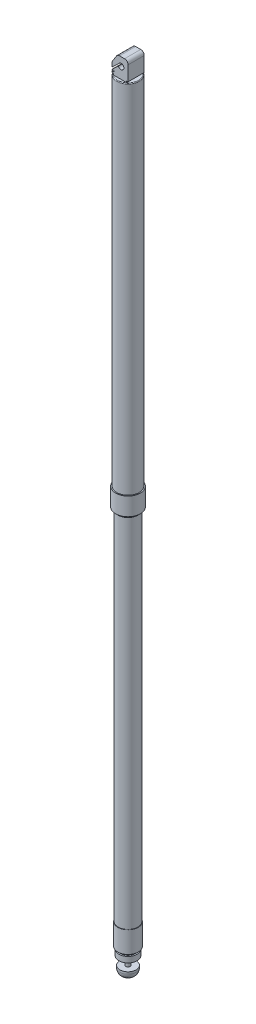
ISO-10303-21;
HEADER;
FILE_DESCRIPTION(('STEP AP214'),'2;1');
FILE_NAME('part.step','',(''),(''),'','','');
FILE_SCHEMA(('AUTOMOTIVE_DESIGN { 1 0 10303 214 1 1 1 1 }'));
ENDSEC;
DATA;
#1=APPLICATION_CONTEXT('core data for automotive mechanical design processes');
#2=APPLICATION_PROTOCOL_DEFINITION('international standard','automotive_design',2000,#1);
#3=PRODUCT_CONTEXT('',#1,'mechanical');
#4=PRODUCT('Part','Part','',(#3));
#5=PRODUCT_RELATED_PRODUCT_CATEGORY('part','',(#4));
#6=PRODUCT_DEFINITION_FORMATION('','',#4);
#7=PRODUCT_DEFINITION_CONTEXT('part definition',#1,'design');
#8=PRODUCT_DEFINITION('design','',#6,#7);
#9=PRODUCT_DEFINITION_SHAPE('','',#8);
#10=(LENGTH_UNIT() NAMED_UNIT(*) SI_UNIT(.MILLI.,.METRE.));
#11=(NAMED_UNIT(*) PLANE_ANGLE_UNIT() SI_UNIT($,.RADIAN.));
#12=(NAMED_UNIT(*) SI_UNIT($,.STERADIAN.) SOLID_ANGLE_UNIT());
#13=UNCERTAINTY_MEASURE_WITH_UNIT(LENGTH_MEASURE(1.E-05),#10,'distance_accuracy_value','');
#14=(GEOMETRIC_REPRESENTATION_CONTEXT(3) GLOBAL_UNCERTAINTY_ASSIGNED_CONTEXT((#13)) GLOBAL_UNIT_ASSIGNED_CONTEXT((#10,
#11,#12)) REPRESENTATION_CONTEXT('',''));
#15=CARTESIAN_POINT('',(0.,0.,0.));
#16=DIRECTION('',(0.,0.,1.));
#17=DIRECTION('',(1.,0.,0.));
#18=AXIS2_PLACEMENT_3D('',#15,#16,#17);
#19=CARTESIAN_POINT('',(-44.5084887446606,-1145.1770228856,0.100800936949499));
#20=DIRECTION('',(0.,-1.,0.));
#21=DIRECTION('',(0.,0.,-1.));
#22=AXIS2_PLACEMENT_3D('',#19,#20,#21);
#23=PLANE('',#22);
#24=CARTESIAN_POINT('',(-44.5084887446606,-1145.1770228856,0.100800936949499));
#25=DIRECTION('',(0.,-1.,0.));
#26=DIRECTION('',(0.,0.,-1.));
#27=AXIS2_PLACEMENT_3D('',#24,#25,#26);
#28=CIRCLE('',#27,13.);
#29=CARTESIAN_POINT('',(-44.5084887446606,-1145.1770228856,-12.8991990630505));
#30=VERTEX_POINT('',#29);
#31=EDGE_CURVE('E437',#30,#30,#28,.T.);
#32=ORIENTED_EDGE('',*,*,#31,.T.);
#33=EDGE_LOOP('',(#32));
#34=FACE_BOUND('',#33,.T.);
#35=CARTESIAN_POINT('',(-44.5084887446606,-1145.1770228856,0.100800936949499));
#36=DIRECTION('',(0.,-1.,0.));
#37=DIRECTION('',(0.,0.,-1.));
#38=AXIS2_PLACEMENT_3D('',#35,#36,#37);
#39=CIRCLE('',#38,3.175);
#40=CARTESIAN_POINT('',(-44.5084887446606,-1145.1770228856,-3.0741990630505));
#41=VERTEX_POINT('',#40);
#42=EDGE_CURVE('E443',#41,#41,#39,.T.);
#43=ORIENTED_EDGE('',*,*,#42,.F.);
#44=EDGE_LOOP('',(#43));
#45=FACE_BOUND('',#44,.T.);
#46=ADVANCED_FACE('F36',(#34,#45),#23,.T.);
#47=CARTESIAN_POINT('',(-48.0084887446606,-30.177022885603,11.5));
#48=DIRECTION('',(0.845905169363301,-0.533333333333334,0.));
#49=DIRECTION('',(0.533333333333334,0.845905169363301,0.));
#50=AXIS2_PLACEMENT_3D('',#47,#48,#49);
#51=PLANE('',#50);
#52=DIRECTION('',(-0.533333333333334,-0.845905169363301,0.));
#53=VECTOR('',#52,1.);
#54=CARTESIAN_POINT('',(-48.0084887446606,-30.177022885603,-11.5));
#55=LINE('',#54,#53);
#56=CARTESIAN_POINT('',(-49.4796281696402,-32.5103562189364,-11.5));
#57=VERTEX_POINT('',#56);
#58=CARTESIAN_POINT('',(-55.2380145914771,-41.6435727966049,-11.5));
#59=VERTEX_POINT('',#58);
#60=EDGE_CURVE('E458',#57,#59,#55,.T.);
#61=ORIENTED_EDGE('',*,*,#60,.T.);
#62=DIRECTION('',(0.,0.,-1.));
#63=VECTOR('',#62,1.);
#64=CARTESIAN_POINT('',(-55.2380145914771,-41.6435727966049,11.5));
#65=LINE('',#64,#63);
#66=CARTESIAN_POINT('',(-55.2380145914771,-41.6435727966049,11.5));
#67=VERTEX_POINT('',#66);
#68=EDGE_CURVE('E59',#59,#67,#65,.F.);
#69=ORIENTED_EDGE('',*,*,#68,.T.);
#70=DIRECTION('',(-0.533333333333334,-0.845905169363301,0.));
#71=VECTOR('',#70,1.);
#72=CARTESIAN_POINT('',(-48.0084887446606,-30.177022885603,11.5));
#73=LINE('',#72,#71);
#74=CARTESIAN_POINT('',(-49.4796281696402,-32.5103562189364,11.5));
#75=VERTEX_POINT('',#74);
#76=EDGE_CURVE('E208',#75,#67,#73,.T.);
#77=ORIENTED_EDGE('',*,*,#76,.F.);
#78=DIRECTION('',(0.,0.,-1.));
#79=VECTOR('',#78,1.);
#80=CARTESIAN_POINT('',(-49.4796281696402,-32.5103562189364,11.5));
#81=LINE('',#80,#79);
#82=EDGE_CURVE('E263',#75,#57,#81,.T.);
#83=ORIENTED_EDGE('',*,*,#82,.T.);
#84=EDGE_LOOP('',(#61,#69,#77,#83));
#85=FACE_BOUND('',#84,.T.);
#86=ADVANCED_FACE('F298',(#85),#51,.F.);
#87=CARTESIAN_POINT('',(-56.0084887446606,-42.8656004260525,11.5));
#88=DIRECTION('',(1.,0.,0.));
#89=DIRECTION('',(0.,1.,0.));
#90=AXIS2_PLACEMENT_3D('',#87,#88,#89);
#91=PLANE('',#90);
#92=DIRECTION('',(0.,-1.,0.));
#93=VECTOR('',#92,1.);
#94=CARTESIAN_POINT('',(-56.0084887446606,-42.8656004260525,11.5));
#95=LINE('',#94,#93);
#96=CARTESIAN_POINT('',(-56.0084887446606,-44.3102394632716,11.5));
#97=VERTEX_POINT('',#96);
#98=CARTESIAN_POINT('',(-56.0084887446606,-49.4403063818967,11.5));
#99=VERTEX_POINT('',#98);
#100=EDGE_CURVE('E460',#97,#99,#95,.T.);
#101=ORIENTED_EDGE('',*,*,#100,.F.);
#102=DIRECTION('',(0.,0.,-1.));
#103=VECTOR('',#102,1.);
#104=CARTESIAN_POINT('',(-56.0084887446606,-44.3102394632716,11.5));
#105=LINE('',#104,#103);
#106=CARTESIAN_POINT('',(-56.0084887446606,-44.3102394632716,-11.5));
#107=VERTEX_POINT('',#106);
#108=EDGE_CURVE('E260',#97,#107,#105,.T.);
#109=ORIENTED_EDGE('',*,*,#108,.T.);
#110=DIRECTION('',(0.,-1.,0.));
#111=VECTOR('',#110,1.);
#112=CARTESIAN_POINT('',(-56.0084887446606,-42.8656004260525,-11.5));
#113=LINE('',#112,#111);
#114=CARTESIAN_POINT('',(-56.0084887446606,-49.4403063818967,-11.5));
#115=VERTEX_POINT('',#114);
#116=EDGE_CURVE('E491',#107,#115,#113,.T.);
#117=ORIENTED_EDGE('',*,*,#116,.T.);
#118=DIRECTION('',(0.,0.,-1.));
#119=VECTOR('',#118,1.);
#120=CARTESIAN_POINT('',(-56.0084887446606,-49.4403063818967,11.5));
#121=LINE('',#120,#119);
#122=EDGE_CURVE('E239',#99,#115,#121,.T.);
#123=ORIENTED_EDGE('',*,*,#122,.F.);
#124=EDGE_LOOP('',(#101,#109,#117,#123));
#125=FACE_BOUND('',#124,.T.);
#126=ADVANCED_FACE('F304',(#125),#91,.F.);
#127=CARTESIAN_POINT('',(-56.0084887446606,-49.4403063818967,11.5));
#128=DIRECTION('',(-0.682588684510633,0.730802769410491,0.));
#129=DIRECTION('',(-0.730802769410491,-0.682588684510633,0.));
#130=AXIS2_PLACEMENT_3D('',#127,#128,#129);
#131=PLANE('',#130);
#132=DIRECTION('',(0.730802769410491,0.682588684510633,0.));
#133=VECTOR('',#132,1.);
#134=CARTESIAN_POINT('',(-56.0084887446606,-49.4403063818967,-11.5));
#135=LINE('',#134,#133);
#136=CARTESIAN_POINT('',(-46.7671581494613,-40.8086646337498,-11.5));
#137=VERTEX_POINT('',#136);
#138=EDGE_CURVE('E493',#115,#137,#135,.T.);
#139=ORIENTED_EDGE('',*,*,#138,.T.);
#140=DIRECTION('',(0.,0.,-1.));
#141=VECTOR('',#140,1.);
#142=CARTESIAN_POINT('',(-46.7671581494613,-40.8086646337498,11.5));
#143=LINE('',#142,#141);
#144=CARTESIAN_POINT('',(-46.7671581494613,-40.8086646337498,11.5));
#145=VERTEX_POINT('',#144);
#146=EDGE_CURVE('E236',#145,#137,#143,.T.);
#147=ORIENTED_EDGE('',*,*,#146,.F.);
#148=DIRECTION('',(0.730802769410491,0.682588684510633,0.));
#149=VECTOR('',#148,1.);
#150=CARTESIAN_POINT('',(-56.0084887446606,-49.4403063818967,11.5));
#151=LINE('',#150,#149);
#152=EDGE_CURVE('E462',#99,#145,#151,.T.);
#153=ORIENTED_EDGE('',*,*,#152,.F.);
#154=ORIENTED_EDGE('',*,*,#122,.T.);
#155=EDGE_LOOP('',(#139,#147,#153,#154));
#156=FACE_BOUND('',#155,.T.);
#157=ADVANCED_FACE('F402',(#156),#131,.F.);
#158=CARTESIAN_POINT('',(-43.0084887446606,-42.177022885603,11.5));
#159=DIRECTION('',(0.,0.,-1.));
#160=DIRECTION('',(-1.,0.,0.));
#161=AXIS2_PLACEMENT_3D('',#158,#159,#160);
#162=CYLINDRICAL_SURFACE('',#161,4.);
#163=CARTESIAN_POINT('',(-43.0084887446606,-42.177022885603,-11.5));
#164=DIRECTION('',(0.,0.,-1.));
#165=DIRECTION('',(1.,0.,0.));
#166=AXIS2_PLACEMENT_3D('',#163,#164,#165);
#167=CIRCLE('',#166,4.);
#168=CARTESIAN_POINT('',(-46.7671581494613,-43.5453811374562,-11.5));
#169=VERTEX_POINT('',#168);
#170=EDGE_CURVE('E495',#137,#169,#167,.T.);
#171=ORIENTED_EDGE('',*,*,#170,.T.);
#172=DIRECTION('',(0.,0.,-1.));
#173=VECTOR('',#172,1.);
#174=CARTESIAN_POINT('',(-46.7671581494613,-43.5453811374562,11.5));
#175=LINE('',#174,#173);
#176=CARTESIAN_POINT('',(-46.7671581494613,-43.5453811374562,11.5));
#177=VERTEX_POINT('',#176);
#178=EDGE_CURVE('E233',#177,#169,#175,.T.);
#179=ORIENTED_EDGE('',*,*,#178,.F.);
#180=CARTESIAN_POINT('',(-43.0084887446606,-42.177022885603,11.5));
#181=DIRECTION('',(0.,0.,-1.));
#182=DIRECTION('',(1.,0.,0.));
#183=AXIS2_PLACEMENT_3D('',#180,#181,#182);
#184=CIRCLE('',#183,4.);
#185=EDGE_CURVE('E464',#145,#177,#184,.T.);
#186=ORIENTED_EDGE('',*,*,#185,.F.);
#187=ORIENTED_EDGE('',*,*,#146,.T.);
#188=EDGE_LOOP('',(#171,#179,#186,#187));
#189=FACE_BOUND('',#188,.T.);
#190=ADVANCED_FACE('F398',(#189),#162,.F.);
#191=CARTESIAN_POINT('',(-46.7671581494613,-43.5453811374562,11.5));
#192=DIRECTION('',(0.682588684510633,-0.730802769410491,0.));
#193=DIRECTION('',(0.730802769410491,0.682588684510633,0.));
#194=AXIS2_PLACEMENT_3D('',#191,#192,#193);
#195=PLANE('',#194);
#196=DIRECTION('',(-0.730802769410491,-0.682588684510633,0.));
#197=VECTOR('',#196,1.);
#198=CARTESIAN_POINT('',(-46.7671581494613,-43.5453811374562,-11.5));
#199=LINE('',#198,#197);
#200=CARTESIAN_POINT('',(-56.0084887446606,-52.177022885603,-11.5));
#201=VERTEX_POINT('',#200);
#202=EDGE_CURVE('E497',#169,#201,#199,.T.);
#203=ORIENTED_EDGE('',*,*,#202,.T.);
#204=DIRECTION('',(0.,0.,-1.));
#205=VECTOR('',#204,1.);
#206=CARTESIAN_POINT('',(-56.0084887446606,-52.177022885603,11.5));
#207=LINE('',#206,#205);
#208=CARTESIAN_POINT('',(-56.0084887446606,-52.177022885603,11.5));
#209=VERTEX_POINT('',#208);
#210=EDGE_CURVE('E230',#209,#201,#207,.T.);
#211=ORIENTED_EDGE('',*,*,#210,.F.);
#212=DIRECTION('',(-0.730802769410491,-0.682588684510633,0.));
#213=VECTOR('',#212,1.);
#214=CARTESIAN_POINT('',(-46.7671581494613,-43.5453811374562,11.5));
#215=LINE('',#214,#213);
#216=EDGE_CURVE('E466',#177,#209,#215,.T.);
#217=ORIENTED_EDGE('',*,*,#216,.F.);
#218=ORIENTED_EDGE('',*,*,#178,.T.);
#219=EDGE_LOOP('',(#203,#211,#217,#218));
#220=FACE_BOUND('',#219,.T.);
#221=ADVANCED_FACE('F394',(#220),#195,.F.);
#222=CARTESIAN_POINT('',(-56.0084887446606,-52.177022885603,11.5));
#223=DIRECTION('',(0.,1.,0.));
#224=DIRECTION('',(-1.,0.,0.));
#225=AXIS2_PLACEMENT_3D('',#222,#223,#224);
#226=PLANE('',#225);
#227=DIRECTION('',(1.,0.,0.));
#228=VECTOR('',#227,1.);
#229=CARTESIAN_POINT('',(-56.0084887446606,-52.177022885603,-11.5));
#230=LINE('',#229,#228);
#231=CARTESIAN_POINT('',(-53.0084887446606,-52.177022885603,-11.5));
#232=VERTEX_POINT('',#231);
#233=EDGE_CURVE('E499',#201,#232,#230,.T.);
#234=ORIENTED_EDGE('',*,*,#233,.T.);
#235=DIRECTION('',(0.,0.,-1.));
#236=VECTOR('',#235,1.);
#237=CARTESIAN_POINT('',(-53.0084887446606,-52.177022885603,11.5));
#238=LINE('',#237,#236);
#239=CARTESIAN_POINT('',(-53.0084887446606,-52.177022885603,11.5));
#240=VERTEX_POINT('',#239);
#241=EDGE_CURVE('E227',#240,#232,#238,.T.);
#242=ORIENTED_EDGE('',*,*,#241,.F.);
#243=DIRECTION('',(1.,0.,0.));
#244=VECTOR('',#243,1.);
#245=CARTESIAN_POINT('',(-56.0084887446606,-52.177022885603,11.5));
#246=LINE('',#245,#244);
#247=EDGE_CURVE('E468',#209,#240,#246,.T.);
#248=ORIENTED_EDGE('',*,*,#247,.F.);
#249=ORIENTED_EDGE('',*,*,#210,.T.);
#250=EDGE_LOOP('',(#234,#242,#248,#249));
#251=FACE_BOUND('',#250,.T.);
#252=ADVANCED_FACE('F390',(#251),#226,.F.);
#253=CARTESIAN_POINT('',(-53.0084887446606,-52.177022885603,11.5));
#254=DIRECTION('',(1.,0.,0.));
#255=DIRECTION('',(0.,0.,-1.));
#256=AXIS2_PLACEMENT_3D('',#253,#254,#255);
#257=PLANE('',#256);
#258=DIRECTION('',(0.,-1.,0.));
#259=VECTOR('',#258,1.);
#260=CARTESIAN_POINT('',(-53.0084887446606,-52.177022885603,-11.5));
#261=LINE('',#260,#259);
#262=CARTESIAN_POINT('',(-53.0084887446606,-54.177022885603,-11.5));
#263=VERTEX_POINT('',#262);
#264=EDGE_CURVE('E501',#232,#263,#261,.T.);
#265=ORIENTED_EDGE('',*,*,#264,.T.);
#266=DIRECTION('',(0.,0.,-1.));
#267=VECTOR('',#266,1.);
#268=CARTESIAN_POINT('',(-53.0084887446606,-54.177022885603,11.5));
#269=LINE('',#268,#267);
#270=CARTESIAN_POINT('',(-53.0084887446606,-54.177022885603,11.5));
#271=VERTEX_POINT('',#270);
#272=EDGE_CURVE('E224',#271,#263,#269,.T.);
#273=ORIENTED_EDGE('',*,*,#272,.F.);
#274=DIRECTION('',(0.,-1.,0.));
#275=VECTOR('',#274,1.);
#276=CARTESIAN_POINT('',(-53.0084887446606,-52.177022885603,11.5));
#277=LINE('',#276,#275);
#278=EDGE_CURVE('E470',#240,#271,#277,.T.);
#279=ORIENTED_EDGE('',*,*,#278,.F.);
#280=ORIENTED_EDGE('',*,*,#241,.T.);
#281=EDGE_LOOP('',(#265,#273,#279,#280));
#282=FACE_BOUND('',#281,.T.);
#283=ADVANCED_FACE('F386',(#282),#257,.F.);
#284=CARTESIAN_POINT('',(-53.0084887446606,-54.177022885603,11.5));
#285=DIRECTION('',(0.,-1.,0.));
#286=DIRECTION('',(1.,0.,0.));
#287=AXIS2_PLACEMENT_3D('',#284,#285,#286);
#288=PLANE('',#287);
#289=DIRECTION('',(-1.,0.,0.));
#290=VECTOR('',#289,1.);
#291=CARTESIAN_POINT('',(-53.0084887446606,-54.177022885603,-11.5));
#292=LINE('',#291,#290);
#293=CARTESIAN_POINT('',(-56.0084887446606,-54.177022885603,-11.5));
#294=VERTEX_POINT('',#293);
#295=EDGE_CURVE('E503',#263,#294,#292,.T.);
#296=ORIENTED_EDGE('',*,*,#295,.T.);
#297=DIRECTION('',(0.,0.,-1.));
#298=VECTOR('',#297,1.);
#299=CARTESIAN_POINT('',(-56.0084887446606,-54.177022885603,11.5));
#300=LINE('',#299,#298);
#301=CARTESIAN_POINT('',(-56.0084887446606,-54.177022885603,11.5));
#302=VERTEX_POINT('',#301);
#303=EDGE_CURVE('E221',#302,#294,#300,.T.);
#304=ORIENTED_EDGE('',*,*,#303,.F.);
#305=DIRECTION('',(-1.,0.,0.));
#306=VECTOR('',#305,1.);
#307=CARTESIAN_POINT('',(-53.0084887446606,-54.177022885603,11.5));
#308=LINE('',#307,#306);
#309=EDGE_CURVE('E472',#271,#302,#308,.T.);
#310=ORIENTED_EDGE('',*,*,#309,.F.);
#311=ORIENTED_EDGE('',*,*,#272,.T.);
#312=EDGE_LOOP('',(#296,#304,#310,#311));
#313=FACE_BOUND('',#312,.T.);
#314=ADVANCED_FACE('F382',(#313),#288,.F.);
#315=CARTESIAN_POINT('',(-56.0084887446606,-54.177022885603,11.5));
#316=DIRECTION('',(1.,0.,0.));
#317=DIRECTION('',(0.,0.,-1.));
#318=AXIS2_PLACEMENT_3D('',#315,#316,#317);
#319=PLANE('',#318);
#320=DIRECTION('',(0.,-1.,0.));
#321=VECTOR('',#320,1.);
#322=CARTESIAN_POINT('',(-56.0084887446606,-54.177022885603,-11.5));
#323=LINE('',#322,#321);
#324=CARTESIAN_POINT('',(-56.0084887446606,-56.177022885603,-11.5));
#325=VERTEX_POINT('',#324);
#326=EDGE_CURVE('E505',#294,#325,#323,.T.);
#327=ORIENTED_EDGE('',*,*,#326,.T.);
#328=DIRECTION('',(0.,0.,-1.));
#329=VECTOR('',#328,1.);
#330=CARTESIAN_POINT('',(-56.0084887446606,-56.177022885603,11.5));
#331=LINE('',#330,#329);
#332=CARTESIAN_POINT('',(-56.0084887446606,-56.177022885603,11.5));
#333=VERTEX_POINT('',#332);
#334=EDGE_CURVE('E218',#333,#325,#331,.T.);
#335=ORIENTED_EDGE('',*,*,#334,.F.);
#336=DIRECTION('',(0.,-1.,0.));
#337=VECTOR('',#336,1.);
#338=CARTESIAN_POINT('',(-56.0084887446606,-54.177022885603,11.5));
#339=LINE('',#338,#337);
#340=EDGE_CURVE('E474',#302,#333,#339,.T.);
#341=ORIENTED_EDGE('',*,*,#340,.F.);
#342=ORIENTED_EDGE('',*,*,#303,.T.);
#343=EDGE_LOOP('',(#327,#335,#341,#342));
#344=FACE_BOUND('',#343,.T.);
#345=ADVANCED_FACE('F378',(#344),#319,.F.);
#346=CARTESIAN_POINT('',(-56.0084887446606,-56.177022885603,11.5));
#347=DIRECTION('',(0.,1.,0.));
#348=DIRECTION('',(0.,0.,1.));
#349=AXIS2_PLACEMENT_3D('',#346,#347,#348);
#350=PLANE('',#349);
#351=DIRECTION('',(1.,0.,0.));
#352=VECTOR('',#351,1.);
#353=CARTESIAN_POINT('',(-56.0084887446606,-56.177022885603,-11.5));
#354=LINE('',#353,#352);
#355=CARTESIAN_POINT('',(-54.0084887446606,-56.177022885603,-11.5));
#356=VERTEX_POINT('',#355);
#357=EDGE_CURVE('E197',#325,#356,#354,.T.);
#358=ORIENTED_EDGE('',*,*,#357,.T.);
#359=DIRECTION('',(0.,0.,-1.));
#360=VECTOR('',#359,1.);
#361=CARTESIAN_POINT('',(-54.0084887446606,-56.177022885603,11.5));
#362=LINE('',#361,#360);
#363=CARTESIAN_POINT('',(-54.0084887446606,-56.177022885603,11.5));
#364=VERTEX_POINT('',#363);
#365=EDGE_CURVE('E215',#364,#356,#362,.T.);
#366=ORIENTED_EDGE('',*,*,#365,.F.);
#367=DIRECTION('',(1.,0.,0.));
#368=VECTOR('',#367,1.);
#369=CARTESIAN_POINT('',(-56.0084887446606,-56.177022885603,11.5));
#370=LINE('',#369,#368);
#371=EDGE_CURVE('E476',#333,#364,#370,.T.);
#372=ORIENTED_EDGE('',*,*,#371,.F.);
#373=ORIENTED_EDGE('',*,*,#334,.T.);
#374=EDGE_LOOP('',(#358,#366,#372,#373));
#375=FACE_BOUND('',#374,.T.);
#376=ADVANCED_FACE('F374',(#375),#350,.F.);
#377=CARTESIAN_POINT('',(-54.0084887446606,-56.177022885603,11.5));
#378=DIRECTION('',(1.,0.,0.));
#379=DIRECTION('',(0.,0.,-1.));
#380=AXIS2_PLACEMENT_3D('',#377,#378,#379);
#381=PLANE('',#380);
#382=DIRECTION('',(0.,-1.,0.));
#383=VECTOR('',#382,1.);
#384=CARTESIAN_POINT('',(-54.0084887446606,-56.177022885603,-11.5));
#385=LINE('',#384,#383);
#386=CARTESIAN_POINT('',(-54.0084887446606,-58.177022885603,-11.5));
#387=VERTEX_POINT('',#386);
#388=EDGE_CURVE('E195',#356,#387,#385,.T.);
#389=ORIENTED_EDGE('',*,*,#388,.T.);
#390=DIRECTION('',(0.,0.,-1.));
#391=VECTOR('',#390,1.);
#392=CARTESIAN_POINT('',(-54.0084887446606,-58.177022885603,11.5));
#393=LINE('',#392,#391);
#394=CARTESIAN_POINT('',(-54.0084887446606,-58.177022885603,11.5));
#395=VERTEX_POINT('',#394);
#396=EDGE_CURVE('E190',#395,#387,#393,.T.);
#397=ORIENTED_EDGE('',*,*,#396,.F.);
#398=DIRECTION('',(0.,-1.,0.));
#399=VECTOR('',#398,1.);
#400=CARTESIAN_POINT('',(-54.0084887446606,-56.177022885603,11.5));
#401=LINE('',#400,#399);
#402=EDGE_CURVE('E478',#364,#395,#401,.T.);
#403=ORIENTED_EDGE('',*,*,#402,.F.);
#404=ORIENTED_EDGE('',*,*,#365,.T.);
#405=EDGE_LOOP('',(#389,#397,#403,#404));
#406=FACE_BOUND('',#405,.T.);
#407=ADVANCED_FACE('F371',(#406),#381,.F.);
#408=CARTESIAN_POINT('',(-35.0084887446606,-58.177022885603,11.5));
#409=DIRECTION('',(-1.,0.,0.));
#410=DIRECTION('',(0.,0.,1.));
#411=AXIS2_PLACEMENT_3D('',#408,#409,#410);
#412=PLANE('',#411);
#413=DIRECTION('',(0.,1.,0.));
#414=VECTOR('',#413,1.);
#415=CARTESIAN_POINT('',(-35.0084887446606,-58.177022885603,-11.5));
#416=LINE('',#415,#414);
#417=CARTESIAN_POINT('',(-35.0084887446606,-58.177022885603,-11.5));
#418=VERTEX_POINT('',#417);
#419=CARTESIAN_POINT('',(-35.0084887446606,-56.177022885603,-11.5));
#420=VERTEX_POINT('',#419);
#421=EDGE_CURVE('E169',#418,#420,#416,.T.);
#422=ORIENTED_EDGE('',*,*,#421,.T.);
#423=DIRECTION('',(0.,0.,-1.));
#424=VECTOR('',#423,1.);
#425=CARTESIAN_POINT('',(-35.0084887446606,-56.177022885603,11.5));
#426=LINE('',#425,#424);
#427=CARTESIAN_POINT('',(-35.0084887446606,-56.177022885603,11.5));
#428=VERTEX_POINT('',#427);
#429=EDGE_CURVE('E191',#428,#420,#426,.T.);
#430=ORIENTED_EDGE('',*,*,#429,.F.);
#431=DIRECTION('',(0.,1.,0.));
#432=VECTOR('',#431,1.);
#433=CARTESIAN_POINT('',(-35.0084887446606,-58.177022885603,11.5));
#434=LINE('',#433,#432);
#435=CARTESIAN_POINT('',(-35.0084887446606,-58.177022885603,11.5));
#436=VERTEX_POINT('',#435);
#437=EDGE_CURVE('E187',#436,#428,#434,.T.);
#438=ORIENTED_EDGE('',*,*,#437,.F.);
#439=DIRECTION('',(0.,0.,-1.));
#440=VECTOR('',#439,1.);
#441=CARTESIAN_POINT('',(-35.0084887446606,-58.177022885603,11.5));
#442=LINE('',#441,#440);
#443=EDGE_CURVE('E185',#436,#418,#442,.T.);
#444=ORIENTED_EDGE('',*,*,#443,.T.);
#445=EDGE_LOOP('',(#422,#430,#438,#444));
#446=FACE_BOUND('',#445,.T.);
#447=ADVANCED_FACE('F186',(#446),#412,.F.);
#448=CARTESIAN_POINT('',(-35.0084887446606,-56.177022885603,11.5));
#449=DIRECTION('',(0.,1.,0.));
#450=DIRECTION('',(0.,0.,1.));
#451=AXIS2_PLACEMENT_3D('',#448,#449,#450);
#452=PLANE('',#451);
#453=DIRECTION('',(1.,0.,0.));
#454=VECTOR('',#453,1.);
#455=CARTESIAN_POINT('',(-35.0084887446606,-56.177022885603,-11.5));
#456=LINE('',#455,#454);
#457=CARTESIAN_POINT('',(-33.0084887446606,-56.177022885603,-11.5));
#458=VERTEX_POINT('',#457);
#459=EDGE_CURVE('E178',#420,#458,#456,.T.);
#460=ORIENTED_EDGE('',*,*,#459,.T.);
#461=DIRECTION('',(0.,0.,-1.));
#462=VECTOR('',#461,1.);
#463=CARTESIAN_POINT('',(-33.0084887446606,-56.177022885603,11.5));
#464=LINE('',#463,#462);
#465=CARTESIAN_POINT('',(-33.0084887446606,-56.177022885603,11.5));
#466=VERTEX_POINT('',#465);
#467=EDGE_CURVE('E209',#466,#458,#464,.T.);
#468=ORIENTED_EDGE('',*,*,#467,.F.);
#469=DIRECTION('',(1.,0.,0.));
#470=VECTOR('',#469,1.);
#471=CARTESIAN_POINT('',(-35.0084887446606,-56.177022885603,11.5));
#472=LINE('',#471,#470);
#473=EDGE_CURVE('E483',#428,#466,#472,.T.);
#474=ORIENTED_EDGE('',*,*,#473,.F.);
#475=ORIENTED_EDGE('',*,*,#429,.T.);
#476=EDGE_LOOP('',(#460,#468,#474,#475));
#477=FACE_BOUND('',#476,.T.);
#478=ADVANCED_FACE('F364',(#477),#452,.F.);
#479=CARTESIAN_POINT('',(-33.0084887446606,-56.177022885603,11.5));
#480=DIRECTION('',(-1.,0.,0.));
#481=DIRECTION('',(0.,0.,1.));
#482=AXIS2_PLACEMENT_3D('',#479,#480,#481);
#483=PLANE('',#482);
#484=DIRECTION('',(0.,1.,0.));
#485=VECTOR('',#484,1.);
#486=CARTESIAN_POINT('',(-33.0084887446606,-56.177022885603,-11.5));
#487=LINE('',#486,#485);
#488=CARTESIAN_POINT('',(-33.0084887446606,-35.177022885603,-11.5));
#489=VERTEX_POINT('',#488);
#490=EDGE_CURVE('E202',#458,#489,#487,.T.);
#491=ORIENTED_EDGE('',*,*,#490,.T.);
#492=DIRECTION('',(0.,0.,-1.));
#493=VECTOR('',#492,1.);
#494=CARTESIAN_POINT('',(-33.0084887446606,-35.177022885603,11.5));
#495=LINE('',#494,#493);
#496=CARTESIAN_POINT('',(-33.0084887446606,-35.177022885603,11.5));
#497=VERTEX_POINT('',#496);
#498=EDGE_CURVE('E253',#489,#497,#495,.F.);
#499=ORIENTED_EDGE('',*,*,#498,.T.);
#500=DIRECTION('',(0.,1.,0.));
#501=VECTOR('',#500,1.);
#502=CARTESIAN_POINT('',(-33.0084887446606,-56.177022885603,11.5));
#503=LINE('',#502,#501);
#504=EDGE_CURVE('E485',#466,#497,#503,.T.);
#505=ORIENTED_EDGE('',*,*,#504,.F.);
#506=ORIENTED_EDGE('',*,*,#467,.T.);
#507=EDGE_LOOP('',(#491,#499,#505,#506));
#508=FACE_BOUND('',#507,.T.);
#509=ADVANCED_FACE('F360',(#508),#483,.F.);
#510=CARTESIAN_POINT('',(-33.0084887446606,-30.177022885603,11.5));
#511=DIRECTION('',(0.,-1.,0.));
#512=DIRECTION('',(1.,0.,0.));
#513=AXIS2_PLACEMENT_3D('',#510,#511,#512);
#514=PLANE('',#513);
#515=DIRECTION('',(-1.,0.,0.));
#516=VECTOR('',#515,1.);
#517=CARTESIAN_POINT('',(-33.0084887446606,-30.177022885603,11.5));
#518=LINE('',#517,#516);
#519=CARTESIAN_POINT('',(-38.0084887446606,-30.177022885603,11.5));
#520=VERTEX_POINT('',#519);
#521=CARTESIAN_POINT('',(-45.2501023228237,-30.177022885603,11.5));
#522=VERTEX_POINT('',#521);
#523=EDGE_CURVE('E212',#520,#522,#518,.T.);
#524=ORIENTED_EDGE('',*,*,#523,.F.);
#525=DIRECTION('',(0.,0.,-1.));
#526=VECTOR('',#525,1.);
#527=CARTESIAN_POINT('',(-38.0084887446606,-30.177022885603,11.5));
#528=LINE('',#527,#526);
#529=CARTESIAN_POINT('',(-38.0084887446606,-30.177022885603,-11.5));
#530=VERTEX_POINT('',#529);
#531=EDGE_CURVE('E244',#520,#530,#528,.T.);
#532=ORIENTED_EDGE('',*,*,#531,.T.);
#533=DIRECTION('',(-1.,0.,0.));
#534=VECTOR('',#533,1.);
#535=CARTESIAN_POINT('',(-33.0084887446606,-30.177022885603,-11.5));
#536=LINE('',#535,#534);
#537=CARTESIAN_POINT('',(-45.2501023228237,-30.177022885603,-11.5));
#538=VERTEX_POINT('',#537);
#539=EDGE_CURVE('E205',#530,#538,#536,.T.);
#540=ORIENTED_EDGE('',*,*,#539,.T.);
#541=DIRECTION('',(0.,0.,-1.));
#542=VECTOR('',#541,1.);
#543=CARTESIAN_POINT('',(-45.2501023228237,-30.177022885603,11.5));
#544=LINE('',#543,#542);
#545=EDGE_CURVE('E242',#538,#522,#544,.F.);
#546=ORIENTED_EDGE('',*,*,#545,.T.);
#547=EDGE_LOOP('',(#524,#532,#540,#546));
#548=FACE_BOUND('',#547,.T.);
#549=ADVANCED_FACE('F354',(#548),#514,.F.);
#550=CARTESIAN_POINT('',(-43.0084887446606,-42.177022885603,11.5));
#551=DIRECTION('',(0.,0.,1.));
#552=DIRECTION('',(1.,0.,0.));
#553=AXIS2_PLACEMENT_3D('',#550,#551,#552);
#554=PLANE('',#553);
#555=ORIENTED_EDGE('',*,*,#504,.T.);
#556=CARTESIAN_POINT('',(-38.0084887446606,-35.177022885603,11.5));
#557=DIRECTION('',(0.,0.,1.));
#558=DIRECTION('',(1.,0.,0.));
#559=AXIS2_PLACEMENT_3D('',#556,#557,#558);
#560=CIRCLE('',#559,5.);
#561=EDGE_CURVE('E258',#497,#520,#560,.T.);
#562=ORIENTED_EDGE('',*,*,#561,.T.);
#563=ORIENTED_EDGE('',*,*,#523,.T.);
#564=CARTESIAN_POINT('',(-45.2501023228237,-35.177022885603,11.5));
#565=DIRECTION('',(0.,0.,1.));
#566=DIRECTION('',(1.,0.,0.));
#567=AXIS2_PLACEMENT_3D('',#564,#565,#566);
#568=CIRCLE('',#567,5.);
#569=EDGE_CURVE('E255',#522,#75,#568,.T.);
#570=ORIENTED_EDGE('',*,*,#569,.T.);
#571=ORIENTED_EDGE('',*,*,#76,.T.);
#572=CARTESIAN_POINT('',(-51.0084887446606,-44.3102394632716,11.5));
#573=DIRECTION('',(0.,0.,1.));
#574=DIRECTION('',(1.,0.,0.));
#575=AXIS2_PLACEMENT_3D('',#572,#573,#574);
#576=CIRCLE('',#575,5.);
#577=EDGE_CURVE('E51',#67,#97,#576,.T.);
#578=ORIENTED_EDGE('',*,*,#577,.T.);
#579=ORIENTED_EDGE('',*,*,#100,.T.);
#580=ORIENTED_EDGE('',*,*,#152,.T.);
#581=ORIENTED_EDGE('',*,*,#185,.T.);
#582=ORIENTED_EDGE('',*,*,#216,.T.);
#583=ORIENTED_EDGE('',*,*,#247,.T.);
#584=ORIENTED_EDGE('',*,*,#278,.T.);
#585=ORIENTED_EDGE('',*,*,#309,.T.);
#586=ORIENTED_EDGE('',*,*,#340,.T.);
#587=ORIENTED_EDGE('',*,*,#371,.T.);
#588=ORIENTED_EDGE('',*,*,#402,.T.);
#589=DIRECTION('',(1.,0.,0.));
#590=VECTOR('',#589,1.);
#591=CARTESIAN_POINT('',(-54.0084887446606,-58.177022885603,11.5));
#592=LINE('',#591,#590);
#593=EDGE_CURVE('E480',#395,#436,#592,.T.);
#594=ORIENTED_EDGE('',*,*,#593,.T.);
#595=ORIENTED_EDGE('',*,*,#437,.T.);
#596=ORIENTED_EDGE('',*,*,#473,.T.);
#597=EDGE_LOOP('',(#555,#562,#563,#570,#571,#578,#579,#580,#581,#582,#583,#584,#585,#586,#587,
#588,#594,#595,#596));
#598=FACE_BOUND('',#597,.T.);
#599=ADVANCED_FACE('F351',(#598),#554,.T.);
#600=CARTESIAN_POINT('',(-43.0084887446606,-42.177022885603,-11.5));
#601=DIRECTION('',(0.,0.,1.));
#602=DIRECTION('',(1.,0.,0.));
#603=AXIS2_PLACEMENT_3D('',#600,#601,#602);
#604=PLANE('',#603);
#605=ORIENTED_EDGE('',*,*,#539,.F.);
#606=CARTESIAN_POINT('',(-38.0084887446606,-35.177022885603,-11.5));
#607=DIRECTION('',(0.,0.,1.));
#608=DIRECTION('',(1.,0.,0.));
#609=AXIS2_PLACEMENT_3D('',#606,#607,#608);
#610=CIRCLE('',#609,5.);
#611=EDGE_CURVE('E251',#530,#489,#610,.F.);
#612=ORIENTED_EDGE('',*,*,#611,.T.);
#613=ORIENTED_EDGE('',*,*,#490,.F.);
#614=ORIENTED_EDGE('',*,*,#459,.F.);
#615=ORIENTED_EDGE('',*,*,#421,.F.);
#616=DIRECTION('',(1.,0.,0.));
#617=VECTOR('',#616,1.);
#618=CARTESIAN_POINT('',(-54.0084887446606,-58.177022885603,-11.5));
#619=LINE('',#618,#617);
#620=EDGE_CURVE('E175',#387,#418,#619,.T.);
#621=ORIENTED_EDGE('',*,*,#620,.F.);
#622=ORIENTED_EDGE('',*,*,#388,.F.);
#623=ORIENTED_EDGE('',*,*,#357,.F.);
#624=ORIENTED_EDGE('',*,*,#326,.F.);
#625=ORIENTED_EDGE('',*,*,#295,.F.);
#626=ORIENTED_EDGE('',*,*,#264,.F.);
#627=ORIENTED_EDGE('',*,*,#233,.F.);
#628=ORIENTED_EDGE('',*,*,#202,.F.);
#629=ORIENTED_EDGE('',*,*,#170,.F.);
#630=ORIENTED_EDGE('',*,*,#138,.F.);
#631=ORIENTED_EDGE('',*,*,#116,.F.);
#632=CARTESIAN_POINT('',(-51.0084887446606,-44.3102394632716,-11.5));
#633=DIRECTION('',(0.,0.,1.));
#634=DIRECTION('',(1.,0.,0.));
#635=AXIS2_PLACEMENT_3D('',#632,#633,#634);
#636=CIRCLE('',#635,5.);
#637=EDGE_CURVE('E249',#107,#59,#636,.F.);
#638=ORIENTED_EDGE('',*,*,#637,.T.);
#639=ORIENTED_EDGE('',*,*,#60,.F.);
#640=CARTESIAN_POINT('',(-45.2501023228237,-35.177022885603,-11.5));
#641=DIRECTION('',(0.,0.,1.));
#642=DIRECTION('',(1.,0.,0.));
#643=AXIS2_PLACEMENT_3D('',#640,#641,#642);
#644=CIRCLE('',#643,5.);
#645=EDGE_CURVE('E247',#57,#538,#644,.F.);
#646=ORIENTED_EDGE('',*,*,#645,.T.);
#647=EDGE_LOOP('',(#605,#612,#613,#614,#615,#621,#622,#623,#624,#625,#626,#627,#628,#629,#630,
#631,#638,#639,#646));
#648=FACE_BOUND('',#647,.T.);
#649=ADVANCED_FACE('F172',(#648),#604,.F.);
#650=CARTESIAN_POINT('',(-38.0084887446606,-35.177022885603,11.5));
#651=DIRECTION('',(0.,0.,-1.));
#652=DIRECTION('',(-1.,0.,0.));
#653=AXIS2_PLACEMENT_3D('',#650,#651,#652);
#654=CYLINDRICAL_SURFACE('',#653,5.);
#655=ORIENTED_EDGE('',*,*,#561,.F.);
#656=ORIENTED_EDGE('',*,*,#498,.F.);
#657=ORIENTED_EDGE('',*,*,#611,.F.);
#658=ORIENTED_EDGE('',*,*,#531,.F.);
#659=EDGE_LOOP('',(#655,#656,#657,#658));
#660=FACE_BOUND('',#659,.T.);
#661=ADVANCED_FACE('F357',(#660),#654,.T.);
#662=CARTESIAN_POINT('',(-51.0084887446606,-44.3102394632716,11.5));
#663=DIRECTION('',(0.,0.,-1.));
#664=DIRECTION('',(-1.,0.,0.));
#665=AXIS2_PLACEMENT_3D('',#662,#663,#664);
#666=CYLINDRICAL_SURFACE('',#665,5.);
#667=ORIENTED_EDGE('',*,*,#577,.F.);
#668=ORIENTED_EDGE('',*,*,#68,.F.);
#669=ORIENTED_EDGE('',*,*,#637,.F.);
#670=ORIENTED_EDGE('',*,*,#108,.F.);
#671=EDGE_LOOP('',(#667,#668,#669,#670));
#672=FACE_BOUND('',#671,.T.);
#673=ADVANCED_FACE('F412',(#672),#666,.T.);
#674=CARTESIAN_POINT('',(-45.2501023228237,-35.177022885603,11.5));
#675=DIRECTION('',(0.,0.,-1.));
#676=DIRECTION('',(-1.,0.,0.));
#677=AXIS2_PLACEMENT_3D('',#674,#675,#676);
#678=CYLINDRICAL_SURFACE('',#677,5.);
#679=ORIENTED_EDGE('',*,*,#569,.F.);
#680=ORIENTED_EDGE('',*,*,#545,.F.);
#681=ORIENTED_EDGE('',*,*,#645,.F.);
#682=ORIENTED_EDGE('',*,*,#82,.F.);
#683=EDGE_LOOP('',(#679,#680,#681,#682));
#684=FACE_BOUND('',#683,.T.);
#685=ADVANCED_FACE('F349',(#684),#678,.T.);
#686=CARTESIAN_POINT('',(-44.5084887446606,-566.177022885603,0.100800936949499));
#687=DIRECTION('',(0.,1.,0.));
#688=DIRECTION('',(0.,0.,1.));
#689=AXIS2_PLACEMENT_3D('',#686,#687,#688);
#690=CYLINDRICAL_SURFACE('',#689,16.);
#691=CARTESIAN_POINT('',(-44.5084887446606,-59.177022885603,0.100800936949499));
#692=DIRECTION('',(0.,-1.,0.));
#693=DIRECTION('',(0.,0.,-1.));
#694=AXIS2_PLACEMENT_3D('',#691,#692,#693);
#695=CIRCLE('',#694,16.);
#696=CARTESIAN_POINT('',(-44.5084887446606,-59.177022885603,-15.8991990630505));
#697=VERTEX_POINT('',#696);
#698=EDGE_CURVE('E267',#697,#697,#695,.T.);
#699=ORIENTED_EDGE('',*,*,#698,.T.);
#700=EDGE_LOOP('',(#699));
#701=FACE_BOUND('',#700,.T.);
#702=CARTESIAN_POINT('',(-44.5084887446606,-566.177022885603,0.100800936949499));
#703=DIRECTION('',(0.,-1.,0.));
#704=DIRECTION('',(0.,0.,-1.));
#705=AXIS2_PLACEMENT_3D('',#702,#703,#704);
#706=CIRCLE('',#705,16.);
#707=CARTESIAN_POINT('',(-44.5084887446606,-566.177022885603,-15.8991990630505));
#708=VERTEX_POINT('',#707);
#709=EDGE_CURVE('E455',#708,#708,#706,.T.);
#710=ORIENTED_EDGE('',*,*,#709,.F.);
#711=EDGE_LOOP('',(#710));
#712=FACE_BOUND('',#711,.T.);
#713=ADVANCED_FACE('F345',(#701,#712),#690,.T.);
#714=CARTESIAN_POINT('',(-44.5084887446606,-58.177022885603,0.100800936949499));
#715=DIRECTION('',(0.,-1.,0.));
#716=DIRECTION('',(0.,0.,-1.));
#717=AXIS2_PLACEMENT_3D('',#714,#715,#716);
#718=PLANE('',#717);
#719=CARTESIAN_POINT('',(-44.5084887446606,-58.177022885603,0.100800936949499));
#720=DIRECTION('',(0.,-1.,0.));
#721=DIRECTION('',(0.,0.,-1.));
#722=AXIS2_PLACEMENT_3D('',#719,#720,#721);
#723=CIRCLE('',#722,15.);
#724=CARTESIAN_POINT('',(-44.5084887446606,-58.177022885603,-14.8991990630505));
#725=VERTEX_POINT('',#724);
#726=EDGE_CURVE('E270',#725,#725,#723,.F.);
#727=ORIENTED_EDGE('',*,*,#726,.T.);
#728=EDGE_LOOP('',(#727));
#729=FACE_BOUND('',#728,.T.);
#730=ORIENTED_EDGE('',*,*,#593,.F.);
#731=ORIENTED_EDGE('',*,*,#396,.T.);
#732=ORIENTED_EDGE('',*,*,#620,.T.);
#733=ORIENTED_EDGE('',*,*,#443,.F.);
#734=EDGE_LOOP('',(#730,#731,#732,#733));
#735=FACE_BOUND('',#734,.T.);
#736=ADVANCED_FACE('F193',(#729,#735),#718,.F.);
#737=CARTESIAN_POINT('',(-44.5084887446606,-59.177022885603,0.100800936949499));
#738=DIRECTION('',(0.,-1.,0.));
#739=DIRECTION('',(0.,0.,-1.));
#740=AXIS2_PLACEMENT_3D('',#737,#738,#739);
#741=TOROIDAL_SURFACE('',#740,15.,1.);
#742=ORIENTED_EDGE('',*,*,#726,.F.);
#743=EDGE_LOOP('',(#742));
#744=FACE_BOUND('',#743,.T.);
#745=ORIENTED_EDGE('',*,*,#698,.F.);
#746=EDGE_LOOP('',(#745));
#747=FACE_BOUND('',#746,.T.);
#748=ADVANCED_FACE('F338',(#744,#747),#741,.T.);
#749=CARTESIAN_POINT('',(-44.5084887446606,-566.177022885603,0.100800936949499));
#750=DIRECTION('',(0.,-1.,0.));
#751=DIRECTION('',(0.,0.,-1.));
#752=AXIS2_PLACEMENT_3D('',#749,#750,#751);
#753=PLANE('',#752);
#754=CARTESIAN_POINT('',(-44.5084887446606,-566.177022885603,0.100800936949499));
#755=DIRECTION('',(0.,-1.,0.));
#756=DIRECTION('',(0.,0.,-1.));
#757=AXIS2_PLACEMENT_3D('',#754,#755,#756);
#758=CIRCLE('',#757,17.5);
#759=CARTESIAN_POINT('',(-44.5084887446606,-566.177022885603,-17.3991990630505));
#760=VERTEX_POINT('',#759);
#761=EDGE_CURVE('E452',#760,#760,#758,.T.);
#762=ORIENTED_EDGE('',*,*,#761,.F.);
#763=EDGE_LOOP('',(#762));
#764=FACE_BOUND('',#763,.T.);
#765=ORIENTED_EDGE('',*,*,#709,.T.);
#766=EDGE_LOOP('',(#765));
#767=FACE_BOUND('',#766,.T.);
#768=ADVANCED_FACE('F334',(#764,#767),#753,.F.);
#769=CARTESIAN_POINT('',(-44.5084887446606,-595.177022885603,0.100800936949499));
#770=DIRECTION('',(0.,1.,0.));
#771=DIRECTION('',(0.,0.,1.));
#772=AXIS2_PLACEMENT_3D('',#769,#770,#771);
#773=CYLINDRICAL_SURFACE('',#772,17.5);
#774=CARTESIAN_POINT('',(-44.5084887446606,-591.677022885603,0.100800936949499));
#775=DIRECTION('',(0.,-1.,0.));
#776=DIRECTION('',(0.,0.,-1.));
#777=AXIS2_PLACEMENT_3D('',#774,#775,#776);
#778=CIRCLE('',#777,17.5);
#779=CARTESIAN_POINT('',(-44.5084887446606,-591.677022885603,-17.3991990630505));
#780=VERTEX_POINT('',#779);
#781=EDGE_CURVE('E276',#780,#780,#778,.F.);
#782=ORIENTED_EDGE('',*,*,#781,.T.);
#783=EDGE_LOOP('',(#782));
#784=FACE_BOUND('',#783,.T.);
#785=ORIENTED_EDGE('',*,*,#761,.T.);
#786=EDGE_LOOP('',(#785));
#787=FACE_BOUND('',#786,.T.);
#788=ADVANCED_FACE('F337',(#784,#787),#773,.T.);
#789=CARTESIAN_POINT('',(-44.5084887446606,-595.177022885603,0.100800936949499));
#790=DIRECTION('',(0.,1.,0.));
#791=DIRECTION('',(0.,0.,1.));
#792=AXIS2_PLACEMENT_3D('',#789,#790,#791);
#793=CONICAL_SURFACE('',#792,14.0000000000003,0.78539816339744);
#794=ORIENTED_EDGE('',*,*,#781,.F.);
#795=EDGE_LOOP('',(#794));
#796=FACE_BOUND('',#795,.T.);
#797=CARTESIAN_POINT('',(-44.5084887446606,-595.177022885603,0.100800936949499));
#798=DIRECTION('',(0.,-1.,0.));
#799=DIRECTION('',(0.,0.,-1.));
#800=AXIS2_PLACEMENT_3D('',#797,#798,#799);
#801=CIRCLE('',#800,14.0000000000003);
#802=CARTESIAN_POINT('',(-44.5084887446606,-595.177022885603,-13.8991990630508));
#803=VERTEX_POINT('',#802);
#804=EDGE_CURVE('E273',#803,#803,#801,.T.);
#805=ORIENTED_EDGE('',*,*,#804,.F.);
#806=EDGE_LOOP('',(#805));
#807=FACE_BOUND('',#806,.T.);
#808=ADVANCED_FACE('F332',(#796,#807),#793,.T.);
#809=CARTESIAN_POINT('',(-44.5084887446606,-1103.1770228856,0.100800936949499));
#810=DIRECTION('',(0.,1.,0.));
#811=DIRECTION('',(0.,0.,1.));
#812=AXIS2_PLACEMENT_3D('',#809,#810,#811);
#813=CYLINDRICAL_SURFACE('',#812,14.0000000000004);
#814=CARTESIAN_POINT('',(-44.5084887446606,-1103.1770228856,0.100800936949499));
#815=DIRECTION('',(0.,-1.,0.));
#816=DIRECTION('',(0.,0.,-1.));
#817=AXIS2_PLACEMENT_3D('',#814,#815,#816);
#818=CIRCLE('',#817,14.0000000000004);
#819=CARTESIAN_POINT('',(-44.5084887446606,-1103.1770228856,-13.8991990630509));
#820=VERTEX_POINT('',#819);
#821=EDGE_CURVE('E449',#820,#820,#818,.T.);
#822=ORIENTED_EDGE('',*,*,#821,.F.);
#823=EDGE_LOOP('',(#822));
#824=FACE_BOUND('',#823,.T.);
#825=ORIENTED_EDGE('',*,*,#804,.T.);
#826=EDGE_LOOP('',(#825));
#827=FACE_BOUND('',#826,.T.);
#828=ADVANCED_FACE('F325',(#824,#827),#813,.T.);
#829=CARTESIAN_POINT('',(-44.5084887446606,-1103.1770228856,0.100800936949499));
#830=DIRECTION('',(0.,-1.,0.));
#831=DIRECTION('',(0.,0.,-1.));
#832=AXIS2_PLACEMENT_3D('',#829,#830,#831);
#833=PLANE('',#832);
#834=CARTESIAN_POINT('',(-44.5084887446606,-1103.1770228856,0.100800936949499));
#835=DIRECTION('',(0.,-1.,0.));
#836=DIRECTION('',(0.,0.,-1.));
#837=AXIS2_PLACEMENT_3D('',#834,#835,#836);
#838=CIRCLE('',#837,14.5);
#839=CARTESIAN_POINT('',(-44.5084887446606,-1103.1770228856,-14.3991990630505));
#840=VERTEX_POINT('',#839);
#841=EDGE_CURVE('E440',#840,#840,#838,.T.);
#842=ORIENTED_EDGE('',*,*,#841,.F.);
#843=EDGE_LOOP('',(#842));
#844=FACE_BOUND('',#843,.T.);
#845=ORIENTED_EDGE('',*,*,#821,.T.);
#846=EDGE_LOOP('',(#845));
#847=FACE_BOUND('',#846,.T.);
#848=ADVANCED_FACE('F321',(#844,#847),#833,.F.);
#849=CARTESIAN_POINT('',(-44.5084887446606,-1137.1770228856,0.100800936949499));
#850=DIRECTION('',(0.,1.,0.));
#851=DIRECTION('',(0.,0.,1.));
#852=AXIS2_PLACEMENT_3D('',#849,#850,#851);
#853=CYLINDRICAL_SURFACE('',#852,14.5);
#854=CARTESIAN_POINT('',(-44.5084887446606,-1133.6770228856,0.100800936949499));
#855=DIRECTION('',(0.,-1.,0.));
#856=DIRECTION('',(0.,0.,-1.));
#857=AXIS2_PLACEMENT_3D('',#854,#855,#856);
#858=CIRCLE('',#857,14.5);
#859=CARTESIAN_POINT('',(-44.5084887446606,-1133.6770228856,-14.3991990630505));
#860=VERTEX_POINT('',#859);
#861=EDGE_CURVE('E282',#860,#860,#858,.F.);
#862=ORIENTED_EDGE('',*,*,#861,.T.);
#863=EDGE_LOOP('',(#862));
#864=FACE_BOUND('',#863,.T.);
#865=ORIENTED_EDGE('',*,*,#841,.T.);
#866=EDGE_LOOP('',(#865));
#867=FACE_BOUND('',#866,.T.);
#868=ADVANCED_FACE('F324',(#864,#867),#853,.T.);
#869=CARTESIAN_POINT('',(-44.5084887446606,-1137.1770228856,0.100800936949499));
#870=DIRECTION('',(0.,1.,0.));
#871=DIRECTION('',(0.,0.,1.));
#872=AXIS2_PLACEMENT_3D('',#869,#870,#871);
#873=CONICAL_SURFACE('',#872,10.9999999999999,0.785398163397454);
#874=ORIENTED_EDGE('',*,*,#861,.F.);
#875=EDGE_LOOP('',(#874));
#876=FACE_BOUND('',#875,.T.);
#877=CARTESIAN_POINT('',(-44.5084887446606,-1137.1770228856,0.100800936949499));
#878=DIRECTION('',(0.,-1.,0.));
#879=DIRECTION('',(0.,0.,-1.));
#880=AXIS2_PLACEMENT_3D('',#877,#878,#879);
#881=CIRCLE('',#880,10.9999999999999);
#882=CARTESIAN_POINT('',(-44.5084887446606,-1137.1770228856,-10.8991990630504));
#883=VERTEX_POINT('',#882);
#884=EDGE_CURVE('E279',#883,#883,#881,.T.);
#885=ORIENTED_EDGE('',*,*,#884,.F.);
#886=EDGE_LOOP('',(#885));
#887=FACE_BOUND('',#886,.T.);
#888=ADVANCED_FACE('F319',(#876,#887),#873,.T.);
#889=CARTESIAN_POINT('',(-44.5084887446606,-1145.1770228856,0.100800936949499));
#890=DIRECTION('',(0.,1.,0.));
#891=DIRECTION('',(0.,0.,1.));
#892=AXIS2_PLACEMENT_3D('',#889,#890,#891);
#893=CYLINDRICAL_SURFACE('',#892,13.);
#894=ORIENTED_EDGE('',*,*,#31,.F.);
#895=EDGE_LOOP('',(#894));
#896=FACE_BOUND('',#895,.T.);
#897=CARTESIAN_POINT('',(-44.5084887446606,-1137.1770228856,0.100800936949499));
#898=DIRECTION('',(0.,-1.,0.));
#899=DIRECTION('',(0.,0.,-1.));
#900=AXIS2_PLACEMENT_3D('',#897,#898,#899);
#901=CIRCLE('',#900,13.);
#902=CARTESIAN_POINT('',(-44.5084887446606,-1137.1770228856,-12.8991990630505));
#903=VERTEX_POINT('',#902);
#904=EDGE_CURVE('E435',#903,#903,#901,.T.);
#905=ORIENTED_EDGE('',*,*,#904,.T.);
#906=EDGE_LOOP('',(#905));
#907=FACE_BOUND('',#906,.T.);
#908=ADVANCED_FACE('F315',(#896,#907),#893,.T.);
#909=CARTESIAN_POINT('',(-44.5084887446606,-1137.1770228856,0.100800936949499));
#910=DIRECTION('',(0.,-1.,0.));
#911=DIRECTION('',(0.,0.,-1.));
#912=AXIS2_PLACEMENT_3D('',#909,#910,#911);
#913=PLANE('',#912);
#914=ORIENTED_EDGE('',*,*,#884,.T.);
#915=EDGE_LOOP('',(#914));
#916=FACE_BOUND('',#915,.T.);
#917=ORIENTED_EDGE('',*,*,#904,.F.);
#918=EDGE_LOOP('',(#917));
#919=FACE_BOUND('',#918,.T.);
#920=ADVANCED_FACE('F312',(#916,#919),#913,.F.);
#921=CARTESIAN_POINT('',(-44.5084887446606,-1157.1770228856,0.100800936949499));
#922=DIRECTION('',(0.,1.,0.));
#923=DIRECTION('',(0.,0.,1.));
#924=AXIS2_PLACEMENT_3D('',#921,#922,#923);
#925=CYLINDRICAL_SURFACE('',#924,3.175);
#926=CARTESIAN_POINT('',(-44.5084887446606,-1157.1770228856,0.100800936949499));
#927=DIRECTION('',(0.,-1.,0.));
#928=DIRECTION('',(0.,0.,-1.));
#929=AXIS2_PLACEMENT_3D('',#926,#927,#928);
#930=CIRCLE('',#929,3.175);
#931=CARTESIAN_POINT('',(-44.5084887446606,-1157.1770228856,-3.0741990630505));
#932=VERTEX_POINT('',#931);
#933=EDGE_CURVE('E438',#932,#932,#930,.T.);
#934=ORIENTED_EDGE('',*,*,#933,.F.);
#935=EDGE_LOOP('',(#934));
#936=FACE_BOUND('',#935,.T.);
#937=ORIENTED_EDGE('',*,*,#42,.T.);
#938=EDGE_LOOP('',(#937));
#939=FACE_BOUND('',#938,.T.);
#940=ADVANCED_FACE('F310',(#936,#939),#925,.T.);
#941=CARTESIAN_POINT('',(-44.5084887446606,-1157.1770228856,0.100800936949499));
#942=DIRECTION('',(0.,-1.,0.));
#943=DIRECTION('',(0.,0.,-1.));
#944=AXIS2_PLACEMENT_3D('',#941,#942,#943);
#945=PLANE('',#944);
#946=CARTESIAN_POINT('',(-44.5084887446606,-1157.1770228856,0.100800936949499));
#947=DIRECTION('',(0.,-1.,0.));
#948=DIRECTION('',(0.,0.,-1.));
#949=AXIS2_PLACEMENT_3D('',#946,#947,#948);
#950=CIRCLE('',#949,11.5);
#951=CARTESIAN_POINT('',(-44.5084887446606,-1157.1770228856,-11.3991990630505));
#952=VERTEX_POINT('',#951);
#953=EDGE_CURVE('E558',#952,#952,#950,.T.);
#954=ORIENTED_EDGE('',*,*,#953,.F.);
#955=EDGE_LOOP('',(#954));
#956=FACE_BOUND('',#955,.T.);
#957=ORIENTED_EDGE('',*,*,#933,.T.);
#958=EDGE_LOOP('',(#957));
#959=FACE_BOUND('',#958,.T.);
#960=ADVANCED_FACE('F564',(#956,#959),#945,.F.);
#961=CARTESIAN_POINT('',(-44.5084887446606,-1169.1770228856,0.100800936949499));
#962=DIRECTION('',(0.,1.,0.));
#963=DIRECTION('',(0.,0.,1.));
#964=AXIS2_PLACEMENT_3D('',#961,#962,#963);
#965=CYLINDRICAL_SURFACE('',#964,11.5);
#966=CARTESIAN_POINT('',(-44.5084887446606,-1160.1770228856,0.100800936949499));
#967=DIRECTION('',(0.,-1.,0.));
#968=DIRECTION('',(0.,0.,-1.));
#969=AXIS2_PLACEMENT_3D('',#966,#967,#968);
#970=CIRCLE('',#969,11.5);
#971=CARTESIAN_POINT('',(-44.5084887446606,-1160.1770228856,-11.3991990630505));
#972=VERTEX_POINT('',#971);
#973=EDGE_CURVE('E11',#972,#972,#970,.F.);
#974=ORIENTED_EDGE('',*,*,#973,.T.);
#975=EDGE_LOOP('',(#974));
#976=FACE_BOUND('',#975,.T.);
#977=ORIENTED_EDGE('',*,*,#953,.T.);
#978=EDGE_LOOP('',(#977));
#979=FACE_BOUND('',#978,.T.);
#980=ADVANCED_FACE('F294',(#976,#979),#965,.T.);
#981=CARTESIAN_POINT('',(-44.5084887446606,-1169.1770228856,0.100800936949499));
#982=DIRECTION('',(0.,-1.,0.));
#983=DIRECTION('',(0.,0.,-1.));
#984=AXIS2_PLACEMENT_3D('',#981,#982,#983);
#985=PLANE('',#984);
#986=CARTESIAN_POINT('',(-44.5084887446606,-1169.1770228856,0.100800936949499));
#987=DIRECTION('',(0.,-1.,0.));
#988=DIRECTION('',(0.,0.,-1.));
#989=AXIS2_PLACEMENT_3D('',#986,#987,#988);
#990=CIRCLE('',#989,2.49999999999999);
#991=CARTESIAN_POINT('',(-44.5084887446606,-1169.1770228856,-2.39919906305049));
#992=VERTEX_POINT('',#991);
#993=EDGE_CURVE('E44',#992,#992,#990,.T.);
#994=ORIENTED_EDGE('',*,*,#993,.T.);
#995=EDGE_LOOP('',(#994));
#996=FACE_BOUND('',#995,.T.);
#997=ADVANCED_FACE('F287',(#996),#985,.T.);
#998=CARTESIAN_POINT('',(-44.5084887446606,-1160.1770228856,0.100800936949499));
#999=DIRECTION('',(0.,-1.,0.));
#1000=DIRECTION('',(0.,0.,-1.));
#1001=AXIS2_PLACEMENT_3D('',#998,#999,#1000);
#1002=DEGENERATE_TOROIDAL_SURFACE('',#1001,2.49999999999999,9.00000000000001,.T.);
#1003=ORIENTED_EDGE('',*,*,#973,.F.);
#1004=EDGE_LOOP('',(#1003));
#1005=FACE_BOUND('',#1004,.T.);
#1006=ORIENTED_EDGE('',*,*,#993,.F.);
#1007=EDGE_LOOP('',(#1006));
#1008=FACE_BOUND('',#1007,.T.);
#1009=ADVANCED_FACE('F38',(#1005,#1008),#1002,.T.);
#1010=CLOSED_SHELL('',(#46,#86,#126,#157,#190,#221,#252,#283,#314,#345,#376,#407,#447,#478,#509,
#549,#599,#649,#661,#673,#685,#713,#736,#748,#768,#788,#808,#828,#848,#868,#888,#908,#920,#940,
#960,#980,#997,#1009));
#1011=MANIFOLD_SOLID_BREP('B2',#1010);
#1012=ADVANCED_BREP_SHAPE_REPRESENTATION('',(#18,#1011),#14);
#1013=SHAPE_DEFINITION_REPRESENTATION(#9,#1012);
ENDSEC;
END-ISO-10303-21;
